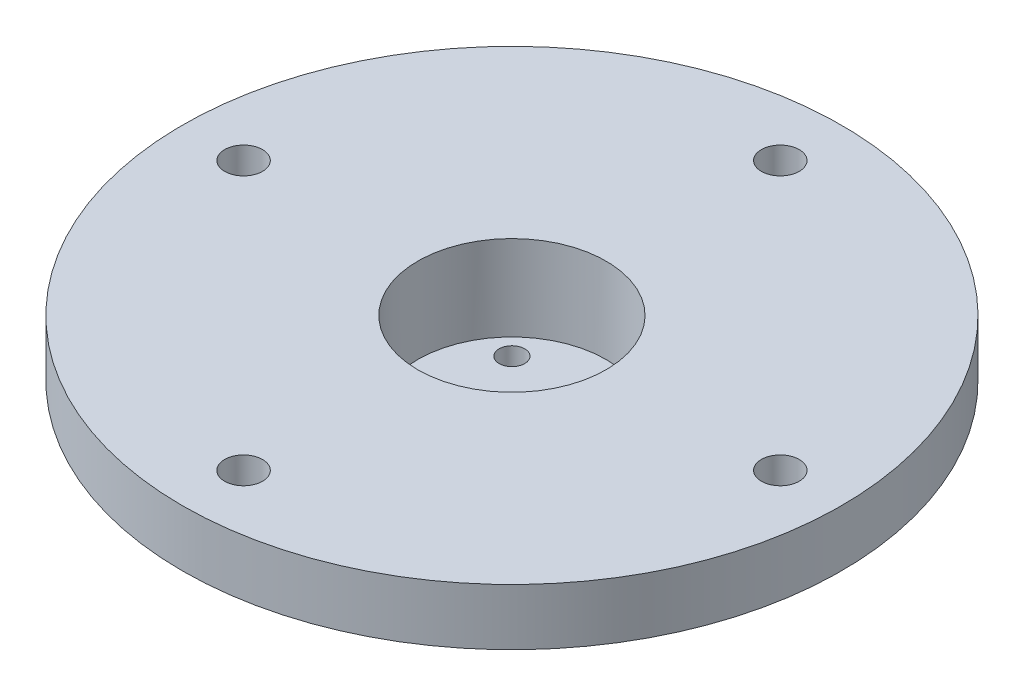
ISO-10303-21;
HEADER;
FILE_DESCRIPTION(('STEP AP214'),'2;1');
FILE_NAME('part.step','',(''),(''),'','','');
FILE_SCHEMA(('AUTOMOTIVE_DESIGN { 1 0 10303 214 1 1 1 1 }'));
ENDSEC;
DATA;
#1=APPLICATION_CONTEXT('core data for automotive mechanical design processes');
#2=APPLICATION_PROTOCOL_DEFINITION('international standard','automotive_design',2000,#1);
#3=PRODUCT_CONTEXT('',#1,'mechanical');
#4=PRODUCT('Part','Part','',(#3));
#5=PRODUCT_RELATED_PRODUCT_CATEGORY('part','',(#4));
#6=PRODUCT_DEFINITION_FORMATION('','',#4);
#7=PRODUCT_DEFINITION_CONTEXT('part definition',#1,'design');
#8=PRODUCT_DEFINITION('design','',#6,#7);
#9=PRODUCT_DEFINITION_SHAPE('','',#8);
#10=(LENGTH_UNIT() NAMED_UNIT(*) SI_UNIT(.MILLI.,.METRE.));
#11=(NAMED_UNIT(*) PLANE_ANGLE_UNIT() SI_UNIT($,.RADIAN.));
#12=(NAMED_UNIT(*) SI_UNIT($,.STERADIAN.) SOLID_ANGLE_UNIT());
#13=UNCERTAINTY_MEASURE_WITH_UNIT(LENGTH_MEASURE(1.E-05),#10,'distance_accuracy_value','');
#14=(GEOMETRIC_REPRESENTATION_CONTEXT(3) GLOBAL_UNCERTAINTY_ASSIGNED_CONTEXT((#13)) GLOBAL_UNIT_ASSIGNED_CONTEXT((#10,
#11,#12)) REPRESENTATION_CONTEXT('',''));
#15=CARTESIAN_POINT('',(0.,0.,0.));
#16=DIRECTION('',(0.,0.,1.));
#17=DIRECTION('',(1.,0.,0.));
#18=AXIS2_PLACEMENT_3D('',#15,#16,#17);
#19=CARTESIAN_POINT('',(0.,25.4,0.));
#20=DIRECTION('',(0.,-1.,0.));
#21=DIRECTION('',(0.,0.,-1.));
#22=AXIS2_PLACEMENT_3D('',#19,#20,#21);
#23=CYLINDRICAL_SURFACE('',#22,15.875);
#24=CARTESIAN_POINT('',(0.,15.4,0.));
#25=DIRECTION('',(0.,1.,0.));
#26=DIRECTION('',(0.,0.,1.));
#27=AXIS2_PLACEMENT_3D('',#24,#25,#26);
#28=CIRCLE('',#27,15.875);
#29=CARTESIAN_POINT('',(0.,15.4,15.875));
#30=VERTEX_POINT('',#29);
#31=EDGE_CURVE('E10',#30,#30,#28,.F.);
#32=ORIENTED_EDGE('',*,*,#31,.T.);
#33=EDGE_LOOP('',(#32));
#34=FACE_BOUND('',#33,.T.);
#35=CARTESIAN_POINT('',(0.,0.,0.));
#36=DIRECTION('',(0.,1.,0.));
#37=DIRECTION('',(0.,0.,1.));
#38=AXIS2_PLACEMENT_3D('',#35,#36,#37);
#39=CIRCLE('',#38,15.875);
#40=CARTESIAN_POINT('',(0.,0.,15.875));
#41=VERTEX_POINT('',#40);
#42=EDGE_CURVE('E46',#41,#41,#39,.T.);
#43=ORIENTED_EDGE('',*,*,#42,.T.);
#44=EDGE_LOOP('',(#43));
#45=FACE_BOUND('',#44,.T.);
#46=ADVANCED_FACE('F33',(#34,#45),#23,.T.);
#47=CARTESIAN_POINT('',(0.,0.,0.));
#48=DIRECTION('',(0.,1.,0.));
#49=DIRECTION('',(0.,0.,1.));
#50=AXIS2_PLACEMENT_3D('',#47,#48,#49);
#51=PLANE('',#50);
#52=CARTESIAN_POINT('',(6.73519209080195,0.,6.73519209080178));
#53=DIRECTION('',(0.,-1.,0.));
#54=DIRECTION('',(0.,0.,-1.));
#55=AXIS2_PLACEMENT_3D('',#52,#53,#54);
#56=CIRCLE('',#55,1.7272);
#57=CARTESIAN_POINT('',(6.73519209080195,0.,5.00799209080178));
#58=VERTEX_POINT('',#57);
#59=EDGE_CURVE('E185',#58,#58,#56,.T.);
#60=ORIENTED_EDGE('',*,*,#59,.F.);
#61=EDGE_LOOP('',(#60));
#62=FACE_BOUND('',#61,.T.);
#63=CARTESIAN_POINT('',(-6.73519209080181,0.,6.73519209080192));
#64=DIRECTION('',(0.,-1.,0.));
#65=DIRECTION('',(0.,0.,-1.));
#66=AXIS2_PLACEMENT_3D('',#63,#64,#65);
#67=CIRCLE('',#66,1.7272);
#68=CARTESIAN_POINT('',(-6.73519209080181,0.,5.00799209080192));
#69=VERTEX_POINT('',#68);
#70=EDGE_CURVE('E181',#69,#69,#67,.T.);
#71=ORIENTED_EDGE('',*,*,#70,.F.);
#72=EDGE_LOOP('',(#71));
#73=FACE_BOUND('',#72,.T.);
#74=CARTESIAN_POINT('',(-6.7351920908019,0.,-6.73519209080183));
#75=DIRECTION('',(0.,-1.,0.));
#76=DIRECTION('',(0.,0.,-1.));
#77=AXIS2_PLACEMENT_3D('',#74,#75,#76);
#78=CIRCLE('',#77,1.7272);
#79=CARTESIAN_POINT('',(-6.7351920908019,0.,-8.46239209080183));
#80=VERTEX_POINT('',#79);
#81=EDGE_CURVE('E171',#80,#80,#78,.T.);
#82=ORIENTED_EDGE('',*,*,#81,.F.);
#83=EDGE_LOOP('',(#82));
#84=FACE_BOUND('',#83,.T.);
#85=CARTESIAN_POINT('',(6.73519209080185,0.,-6.73519209080188));
#86=DIRECTION('',(0.,-1.,0.));
#87=DIRECTION('',(0.,0.,-1.));
#88=AXIS2_PLACEMENT_3D('',#85,#86,#87);
#89=CIRCLE('',#88,1.7272);
#90=CARTESIAN_POINT('',(6.73519209080185,0.,-8.46239209080188));
#91=VERTEX_POINT('',#90);
#92=EDGE_CURVE('E54',#91,#91,#89,.T.);
#93=ORIENTED_EDGE('',*,*,#92,.F.);
#94=EDGE_LOOP('',(#93));
#95=FACE_BOUND('',#94,.T.);
#96=ORIENTED_EDGE('',*,*,#42,.F.);
#97=EDGE_LOOP('',(#96));
#98=FACE_BOUND('',#97,.T.);
#99=ADVANCED_FACE('F107',(#62,#73,#84,#95,#98),#51,.F.);
#100=CARTESIAN_POINT('',(0.,17.78,0.));
#101=DIRECTION('',(0.,1.,0.));
#102=DIRECTION('',(0.,0.,1.));
#103=AXIS2_PLACEMENT_3D('',#100,#101,#102);
#104=CYLINDRICAL_SURFACE('',#103,44.45);
#105=CARTESIAN_POINT('',(0.,17.78,0.));
#106=DIRECTION('',(0.,1.,0.));
#107=DIRECTION('',(0.,0.,1.));
#108=AXIS2_PLACEMENT_3D('',#105,#106,#107);
#109=CIRCLE('',#108,44.45);
#110=CARTESIAN_POINT('',(0.,17.78,44.45));
#111=VERTEX_POINT('',#110);
#112=EDGE_CURVE('E99',#111,#111,#109,.T.);
#113=ORIENTED_EDGE('',*,*,#112,.T.);
#114=EDGE_LOOP('',(#113));
#115=FACE_BOUND('',#114,.T.);
#116=CARTESIAN_POINT('',(0.,25.4,0.));
#117=DIRECTION('',(0.,1.,0.));
#118=DIRECTION('',(0.,0.,1.));
#119=AXIS2_PLACEMENT_3D('',#116,#117,#118);
#120=CIRCLE('',#119,44.45);
#121=CARTESIAN_POINT('',(0.,25.4,44.45));
#122=VERTEX_POINT('',#121);
#123=EDGE_CURVE('E98',#122,#122,#120,.T.);
#124=ORIENTED_EDGE('',*,*,#123,.F.);
#125=EDGE_LOOP('',(#124));
#126=FACE_BOUND('',#125,.T.);
#127=ADVANCED_FACE('F109',(#115,#126),#104,.T.);
#128=CARTESIAN_POINT('',(0.,17.78,0.));
#129=DIRECTION('',(0.,1.,0.));
#130=DIRECTION('',(0.,0.,1.));
#131=AXIS2_PLACEMENT_3D('',#128,#129,#130);
#132=PLANE('',#131);
#133=CARTESIAN_POINT('',(0.,17.78,0.));
#134=DIRECTION('',(0.,1.,0.));
#135=DIRECTION('',(0.,0.,1.));
#136=AXIS2_PLACEMENT_3D('',#133,#134,#135);
#137=CIRCLE('',#136,18.255);
#138=CARTESIAN_POINT('',(0.,17.78,18.255));
#139=VERTEX_POINT('',#138);
#140=EDGE_CURVE('E41',#139,#139,#137,.T.);
#141=ORIENTED_EDGE('',*,*,#140,.T.);
#142=EDGE_LOOP('',(#141));
#143=FACE_BOUND('',#142,.T.);
#144=CARTESIAN_POINT('',(36.195,17.78,1.26374167059427E-13));
#145=DIRECTION('',(0.,1.,0.));
#146=DIRECTION('',(0.,0.,1.));
#147=AXIS2_PLACEMENT_3D('',#144,#145,#146);
#148=CIRCLE('',#147,2.5527);
#149=CARTESIAN_POINT('',(36.195,17.78,2.55270000000013));
#150=VERTEX_POINT('',#149);
#151=EDGE_CURVE('E89',#150,#150,#148,.T.);
#152=ORIENTED_EDGE('',*,*,#151,.T.);
#153=EDGE_LOOP('',(#152));
#154=FACE_BOUND('',#153,.T.);
#155=CARTESIAN_POINT('',(0.,17.78,36.195));
#156=DIRECTION('',(0.,1.,0.));
#157=DIRECTION('',(0.,0.,1.));
#158=AXIS2_PLACEMENT_3D('',#155,#156,#157);
#159=CIRCLE('',#158,2.5527);
#160=CARTESIAN_POINT('',(0.,17.78,38.7477));
#161=VERTEX_POINT('',#160);
#162=EDGE_CURVE('E86',#161,#161,#159,.T.);
#163=ORIENTED_EDGE('',*,*,#162,.T.);
#164=EDGE_LOOP('',(#163));
#165=FACE_BOUND('',#164,.T.);
#166=CARTESIAN_POINT('',(-36.195,17.78,-3.79122501178282E-13));
#167=DIRECTION('',(0.,1.,0.));
#168=DIRECTION('',(0.,0.,1.));
#169=AXIS2_PLACEMENT_3D('',#166,#167,#168);
#170=CIRCLE('',#169,2.5527);
#171=CARTESIAN_POINT('',(-36.195,17.78,2.55269999999962));
#172=VERTEX_POINT('',#171);
#173=EDGE_CURVE('E78',#172,#172,#170,.T.);
#174=ORIENTED_EDGE('',*,*,#173,.T.);
#175=EDGE_LOOP('',(#174));
#176=FACE_BOUND('',#175,.T.);
#177=CARTESIAN_POINT('',(0.,17.78,-36.195));
#178=DIRECTION('',(0.,1.,0.));
#179=DIRECTION('',(0.,0.,1.));
#180=AXIS2_PLACEMENT_3D('',#177,#178,#179);
#181=CIRCLE('',#180,2.5527);
#182=CARTESIAN_POINT('',(0.,17.78,-33.6423));
#183=VERTEX_POINT('',#182);
#184=EDGE_CURVE('E95',#183,#183,#181,.T.);
#185=ORIENTED_EDGE('',*,*,#184,.T.);
#186=EDGE_LOOP('',(#185));
#187=FACE_BOUND('',#186,.T.);
#188=ORIENTED_EDGE('',*,*,#112,.F.);
#189=EDGE_LOOP('',(#188));
#190=FACE_BOUND('',#189,.T.);
#191=ADVANCED_FACE('F116',(#143,#154,#165,#176,#187,#190),#132,.F.);
#192=CARTESIAN_POINT('',(0.,25.4,0.));
#193=DIRECTION('',(0.,1.,0.));
#194=DIRECTION('',(0.,0.,1.));
#195=AXIS2_PLACEMENT_3D('',#192,#193,#194);
#196=PLANE('',#195);
#197=CARTESIAN_POINT('',(0.,25.4,0.));
#198=DIRECTION('',(0.,1.,0.));
#199=DIRECTION('',(0.,0.,1.));
#200=AXIS2_PLACEMENT_3D('',#197,#198,#199);
#201=CIRCLE('',#200,12.7);
#202=CARTESIAN_POINT('',(0.,25.4,12.7));
#203=VERTEX_POINT('',#202);
#204=EDGE_CURVE('E61',#203,#203,#201,.T.);
#205=ORIENTED_EDGE('',*,*,#204,.F.);
#206=EDGE_LOOP('',(#205));
#207=FACE_BOUND('',#206,.T.);
#208=CARTESIAN_POINT('',(36.195,25.4,1.26374167059427E-13));
#209=DIRECTION('',(0.,1.,0.));
#210=DIRECTION('',(-1.,0.,0.));
#211=AXIS2_PLACEMENT_3D('',#208,#209,#210);
#212=CIRCLE('',#211,2.5527);
#213=CARTESIAN_POINT('',(33.6423,25.4,1.17461462645762E-13));
#214=VERTEX_POINT('',#213);
#215=EDGE_CURVE('E75',#214,#214,#212,.T.);
#216=ORIENTED_EDGE('',*,*,#215,.F.);
#217=EDGE_LOOP('',(#216));
#218=FACE_BOUND('',#217,.T.);
#219=CARTESIAN_POINT('',(0.,25.4,36.195));
#220=DIRECTION('',(0.,1.,0.));
#221=DIRECTION('',(0.,0.,-1.));
#222=AXIS2_PLACEMENT_3D('',#219,#220,#221);
#223=CIRCLE('',#222,2.5527);
#224=CARTESIAN_POINT('',(0.,25.4,33.6423));
#225=VERTEX_POINT('',#224);
#226=EDGE_CURVE('E79',#225,#225,#223,.T.);
#227=ORIENTED_EDGE('',*,*,#226,.F.);
#228=EDGE_LOOP('',(#227));
#229=FACE_BOUND('',#228,.T.);
#230=CARTESIAN_POINT('',(-36.195,25.4,-3.79122501178282E-13));
#231=DIRECTION('',(0.,1.,0.));
#232=DIRECTION('',(1.,0.,0.));
#233=AXIS2_PLACEMENT_3D('',#230,#231,#232);
#234=CIRCLE('',#233,2.5527);
#235=CARTESIAN_POINT('',(-33.6423,25.4,-3.52384387937287E-13));
#236=VERTEX_POINT('',#235);
#237=EDGE_CURVE('E70',#236,#236,#234,.T.);
#238=ORIENTED_EDGE('',*,*,#237,.F.);
#239=EDGE_LOOP('',(#238));
#240=FACE_BOUND('',#239,.T.);
#241=CARTESIAN_POINT('',(0.,25.4,-36.195));
#242=DIRECTION('',(0.,1.,0.));
#243=DIRECTION('',(0.,0.,1.));
#244=AXIS2_PLACEMENT_3D('',#241,#242,#243);
#245=CIRCLE('',#244,2.5527);
#246=CARTESIAN_POINT('',(0.,25.4,-33.6423));
#247=VERTEX_POINT('',#246);
#248=EDGE_CURVE('E92',#247,#247,#245,.T.);
#249=ORIENTED_EDGE('',*,*,#248,.F.);
#250=EDGE_LOOP('',(#249));
#251=FACE_BOUND('',#250,.T.);
#252=ORIENTED_EDGE('',*,*,#123,.T.);
#253=EDGE_LOOP('',(#252));
#254=FACE_BOUND('',#253,.T.);
#255=ADVANCED_FACE('F122',(#207,#218,#229,#240,#251,#254),#196,.T.);
#256=CARTESIAN_POINT('',(0.,0.,-36.195));
#257=DIRECTION('',(0.,1.,0.));
#258=DIRECTION('',(0.,0.,1.));
#259=AXIS2_PLACEMENT_3D('',#256,#257,#258);
#260=CYLINDRICAL_SURFACE('',#259,2.5527);
#261=ORIENTED_EDGE('',*,*,#248,.T.);
#262=EDGE_LOOP('',(#261));
#263=FACE_BOUND('',#262,.T.);
#264=ORIENTED_EDGE('',*,*,#184,.F.);
#265=EDGE_LOOP('',(#264));
#266=FACE_BOUND('',#265,.T.);
#267=ADVANCED_FACE('F124',(#263,#266),#260,.F.);
#268=CARTESIAN_POINT('',(-36.195,0.,-3.79122501178282E-13));
#269=DIRECTION('',(0.,1.,0.));
#270=DIRECTION('',(0.,0.,1.));
#271=AXIS2_PLACEMENT_3D('',#268,#269,#270);
#272=CYLINDRICAL_SURFACE('',#271,2.5527);
#273=ORIENTED_EDGE('',*,*,#237,.T.);
#274=EDGE_LOOP('',(#273));
#275=FACE_BOUND('',#274,.T.);
#276=ORIENTED_EDGE('',*,*,#173,.F.);
#277=EDGE_LOOP('',(#276));
#278=FACE_BOUND('',#277,.T.);
#279=ADVANCED_FACE('F132',(#275,#278),#272,.F.);
#280=CARTESIAN_POINT('',(0.,0.,36.195));
#281=DIRECTION('',(0.,1.,0.));
#282=DIRECTION('',(0.,0.,1.));
#283=AXIS2_PLACEMENT_3D('',#280,#281,#282);
#284=CYLINDRICAL_SURFACE('',#283,2.5527);
#285=ORIENTED_EDGE('',*,*,#226,.T.);
#286=EDGE_LOOP('',(#285));
#287=FACE_BOUND('',#286,.T.);
#288=ORIENTED_EDGE('',*,*,#162,.F.);
#289=EDGE_LOOP('',(#288));
#290=FACE_BOUND('',#289,.T.);
#291=ADVANCED_FACE('F136',(#287,#290),#284,.F.);
#292=CARTESIAN_POINT('',(36.195,0.,1.26374167059427E-13));
#293=DIRECTION('',(0.,1.,0.));
#294=DIRECTION('',(0.,0.,1.));
#295=AXIS2_PLACEMENT_3D('',#292,#293,#294);
#296=CYLINDRICAL_SURFACE('',#295,2.5527);
#297=ORIENTED_EDGE('',*,*,#215,.T.);
#298=EDGE_LOOP('',(#297));
#299=FACE_BOUND('',#298,.T.);
#300=ORIENTED_EDGE('',*,*,#151,.F.);
#301=EDGE_LOOP('',(#300));
#302=FACE_BOUND('',#301,.T.);
#303=ADVANCED_FACE('F140',(#299,#302),#296,.F.);
#304=CARTESIAN_POINT('',(0.,13.90396,0.));
#305=DIRECTION('',(0.,-1.,0.));
#306=DIRECTION('',(0.,0.,-1.));
#307=AXIS2_PLACEMENT_3D('',#304,#305,#306);
#308=PLANE('',#307);
#309=CARTESIAN_POINT('',(6.73519209080195,13.90396,6.73519209080178));
#310=DIRECTION('',(0.,-1.,0.));
#311=DIRECTION('',(0.,0.,-1.));
#312=AXIS2_PLACEMENT_3D('',#309,#310,#311);
#313=CIRCLE('',#312,1.7272);
#314=CARTESIAN_POINT('',(6.73519209080195,13.90396,5.00799209080178));
#315=VERTEX_POINT('',#314);
#316=EDGE_CURVE('E37',#315,#315,#313,.T.);
#317=ORIENTED_EDGE('',*,*,#316,.T.);
#318=EDGE_LOOP('',(#317));
#319=FACE_BOUND('',#318,.T.);
#320=CARTESIAN_POINT('',(-6.73519209080181,13.90396,6.73519209080192));
#321=DIRECTION('',(0.,-1.,0.));
#322=DIRECTION('',(0.,0.,-1.));
#323=AXIS2_PLACEMENT_3D('',#320,#321,#322);
#324=CIRCLE('',#323,1.7272);
#325=CARTESIAN_POINT('',(-6.73519209080181,13.90396,5.00799209080192));
#326=VERTEX_POINT('',#325);
#327=EDGE_CURVE('E56',#326,#326,#324,.T.);
#328=ORIENTED_EDGE('',*,*,#327,.T.);
#329=EDGE_LOOP('',(#328));
#330=FACE_BOUND('',#329,.T.);
#331=CARTESIAN_POINT('',(-6.7351920908019,13.90396,-6.73519209080183));
#332=DIRECTION('',(0.,-1.,0.));
#333=DIRECTION('',(0.,0.,-1.));
#334=AXIS2_PLACEMENT_3D('',#331,#332,#333);
#335=CIRCLE('',#334,1.7272);
#336=CARTESIAN_POINT('',(-6.7351920908019,13.90396,-8.46239209080183));
#337=VERTEX_POINT('',#336);
#338=EDGE_CURVE('E53',#337,#337,#335,.T.);
#339=ORIENTED_EDGE('',*,*,#338,.T.);
#340=EDGE_LOOP('',(#339));
#341=FACE_BOUND('',#340,.T.);
#342=CARTESIAN_POINT('',(6.73519209080185,13.90396,-6.73519209080188));
#343=DIRECTION('',(0.,-1.,0.));
#344=DIRECTION('',(0.,0.,-1.));
#345=AXIS2_PLACEMENT_3D('',#342,#343,#344);
#346=CIRCLE('',#345,1.7272);
#347=CARTESIAN_POINT('',(6.73519209080185,13.90396,-8.46239209080188));
#348=VERTEX_POINT('',#347);
#349=EDGE_CURVE('E50',#348,#348,#346,.T.);
#350=ORIENTED_EDGE('',*,*,#349,.T.);
#351=EDGE_LOOP('',(#350));
#352=FACE_BOUND('',#351,.T.);
#353=CARTESIAN_POINT('',(0.,13.90396,0.));
#354=DIRECTION('',(0.,-1.,0.));
#355=DIRECTION('',(0.,0.,-1.));
#356=AXIS2_PLACEMENT_3D('',#353,#354,#355);
#357=CIRCLE('',#356,12.7);
#358=CARTESIAN_POINT('',(0.,13.90396,-12.7));
#359=VERTEX_POINT('',#358);
#360=EDGE_CURVE('E65',#359,#359,#357,.F.);
#361=ORIENTED_EDGE('',*,*,#360,.T.);
#362=EDGE_LOOP('',(#361));
#363=FACE_BOUND('',#362,.T.);
#364=ADVANCED_FACE('F144',(#319,#330,#341,#352,#363),#308,.F.);
#365=CARTESIAN_POINT('',(0.,-22.0170644842766,0.));
#366=DIRECTION('',(0.,1.,0.));
#367=DIRECTION('',(0.,0.,1.));
#368=AXIS2_PLACEMENT_3D('',#365,#366,#367);
#369=CYLINDRICAL_SURFACE('',#368,12.7);
#370=ORIENTED_EDGE('',*,*,#204,.T.);
#371=EDGE_LOOP('',(#370));
#372=FACE_BOUND('',#371,.T.);
#373=ORIENTED_EDGE('',*,*,#360,.F.);
#374=EDGE_LOOP('',(#373));
#375=FACE_BOUND('',#374,.T.);
#376=ADVANCED_FACE('F148',(#372,#375),#369,.F.);
#377=CARTESIAN_POINT('',(0.,17.78,0.));
#378=DIRECTION('',(0.,1.,0.));
#379=DIRECTION('',(0.,0.,1.));
#380=AXIS2_PLACEMENT_3D('',#377,#378,#379);
#381=CONICAL_SURFACE('',#380,18.255,0.785398163397455);
#382=ORIENTED_EDGE('',*,*,#31,.F.);
#383=EDGE_LOOP('',(#382));
#384=FACE_BOUND('',#383,.T.);
#385=ORIENTED_EDGE('',*,*,#140,.F.);
#386=EDGE_LOOP('',(#385));
#387=FACE_BOUND('',#386,.T.);
#388=ADVANCED_FACE('F35',(#384,#387),#381,.T.);
#389=CARTESIAN_POINT('',(6.73519209080185,25.4,-6.73519209080188));
#390=DIRECTION('',(0.,-1.,0.));
#391=DIRECTION('',(0.,0.,-1.));
#392=AXIS2_PLACEMENT_3D('',#389,#390,#391);
#393=CYLINDRICAL_SURFACE('',#392,1.7272);
#394=ORIENTED_EDGE('',*,*,#92,.T.);
#395=EDGE_LOOP('',(#394));
#396=FACE_BOUND('',#395,.T.);
#397=ORIENTED_EDGE('',*,*,#349,.F.);
#398=EDGE_LOOP('',(#397));
#399=FACE_BOUND('',#398,.T.);
#400=ADVANCED_FACE('F151',(#396,#399),#393,.F.);
#401=CARTESIAN_POINT('',(-6.7351920908019,25.4,-6.73519209080183));
#402=DIRECTION('',(0.,-1.,0.));
#403=DIRECTION('',(0.,0.,-1.));
#404=AXIS2_PLACEMENT_3D('',#401,#402,#403);
#405=CYLINDRICAL_SURFACE('',#404,1.7272);
#406=ORIENTED_EDGE('',*,*,#81,.T.);
#407=EDGE_LOOP('',(#406));
#408=FACE_BOUND('',#407,.T.);
#409=ORIENTED_EDGE('',*,*,#338,.F.);
#410=EDGE_LOOP('',(#409));
#411=FACE_BOUND('',#410,.T.);
#412=ADVANCED_FACE('F154',(#408,#411),#405,.F.);
#413=CARTESIAN_POINT('',(-6.73519209080181,25.4,6.73519209080192));
#414=DIRECTION('',(0.,-1.,0.));
#415=DIRECTION('',(0.,0.,-1.));
#416=AXIS2_PLACEMENT_3D('',#413,#414,#415);
#417=CYLINDRICAL_SURFACE('',#416,1.7272);
#418=ORIENTED_EDGE('',*,*,#70,.T.);
#419=EDGE_LOOP('',(#418));
#420=FACE_BOUND('',#419,.T.);
#421=ORIENTED_EDGE('',*,*,#327,.F.);
#422=EDGE_LOOP('',(#421));
#423=FACE_BOUND('',#422,.T.);
#424=ADVANCED_FACE('F159',(#420,#423),#417,.F.);
#425=CARTESIAN_POINT('',(6.73519209080195,25.4,6.73519209080178));
#426=DIRECTION('',(0.,-1.,0.));
#427=DIRECTION('',(0.,0.,-1.));
#428=AXIS2_PLACEMENT_3D('',#425,#426,#427);
#429=CYLINDRICAL_SURFACE('',#428,1.7272);
#430=ORIENTED_EDGE('',*,*,#59,.T.);
#431=EDGE_LOOP('',(#430));
#432=FACE_BOUND('',#431,.T.);
#433=ORIENTED_EDGE('',*,*,#316,.F.);
#434=EDGE_LOOP('',(#433));
#435=FACE_BOUND('',#434,.T.);
#436=ADVANCED_FACE('F156',(#432,#435),#429,.F.);
#437=CLOSED_SHELL('',(#46,#99,#127,#191,#255,#267,#279,#291,#303,#364,#376,#388,#400,#412,#424,#436));
#438=MANIFOLD_SOLID_BREP('B2',#437);
#439=ADVANCED_BREP_SHAPE_REPRESENTATION('',(#18,#438),#14);
#440=SHAPE_DEFINITION_REPRESENTATION(#9,#439);
ENDSEC;
END-ISO-10303-21;
